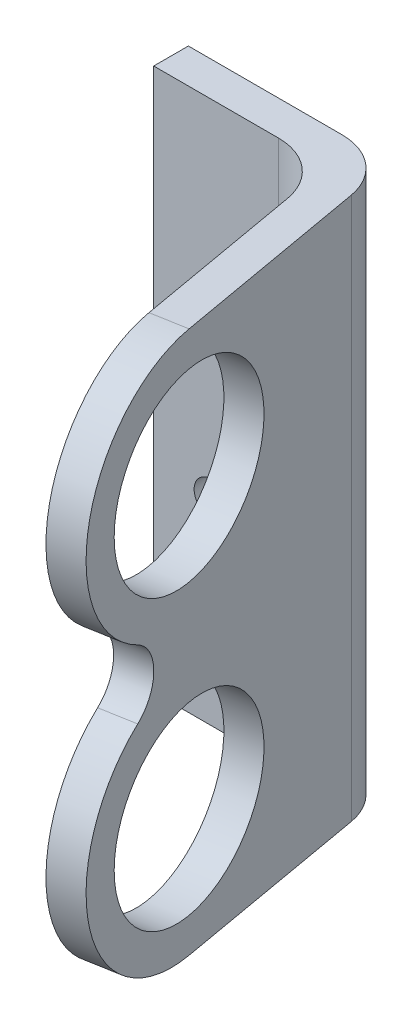
ISO-10303-21;
HEADER;
FILE_DESCRIPTION(('STEP AP214'),'2;1');
FILE_NAME('part.step','',(''),(''),'','','');
FILE_SCHEMA(('AUTOMOTIVE_DESIGN { 1 0 10303 214 1 1 1 1 }'));
ENDSEC;
DATA;
#1=APPLICATION_CONTEXT('core data for automotive mechanical design processes');
#2=APPLICATION_PROTOCOL_DEFINITION('international standard','automotive_design',2000,#1);
#3=PRODUCT_CONTEXT('',#1,'mechanical');
#4=PRODUCT('Part','Part','',(#3));
#5=PRODUCT_RELATED_PRODUCT_CATEGORY('part','',(#4));
#6=PRODUCT_DEFINITION_FORMATION('','',#4);
#7=PRODUCT_DEFINITION_CONTEXT('part definition',#1,'design');
#8=PRODUCT_DEFINITION('design','',#6,#7);
#9=PRODUCT_DEFINITION_SHAPE('','',#8);
#10=(LENGTH_UNIT() NAMED_UNIT(*) SI_UNIT(.MILLI.,.METRE.));
#11=(NAMED_UNIT(*) PLANE_ANGLE_UNIT() SI_UNIT($,.RADIAN.));
#12=(NAMED_UNIT(*) SI_UNIT($,.STERADIAN.) SOLID_ANGLE_UNIT());
#13=UNCERTAINTY_MEASURE_WITH_UNIT(LENGTH_MEASURE(1.E-05),#10,'distance_accuracy_value','');
#14=(GEOMETRIC_REPRESENTATION_CONTEXT(3) GLOBAL_UNCERTAINTY_ASSIGNED_CONTEXT((#13)) GLOBAL_UNIT_ASSIGNED_CONTEXT((#10,
#11,#12)) REPRESENTATION_CONTEXT('',''));
#15=CARTESIAN_POINT('',(0.,0.,0.));
#16=DIRECTION('',(0.,0.,1.));
#17=DIRECTION('',(1.,0.,0.));
#18=AXIS2_PLACEMENT_3D('',#15,#16,#17);
#19=CARTESIAN_POINT('',(17.8888455699224,47.,21.630774973123));
#20=DIRECTION('',(0.984807753012209,0.,-0.173648177666927));
#21=DIRECTION('',(-0.173648177666927,0.,-0.984807753012209));
#22=AXIS2_PLACEMENT_3D('',#19,#20,#21);
#23=PLANE('',#22);
#24=CARTESIAN_POINT('',(15.9787156155862,36.,10.7978896899887));
#25=DIRECTION('',(-0.984807753012209,0.,0.173648177666927));
#26=DIRECTION('',(0.173648177666927,0.,0.984807753012209));
#27=AXIS2_PLACEMENT_3D('',#24,#25,#26);
#28=CIRCLE('',#27,8.);
#29=CARTESIAN_POINT('',(17.3679010369217,36.,18.6763517140864));
#30=VERTEX_POINT('',#29);
#31=EDGE_CURVE('E229',#30,#30,#28,.T.);
#32=ORIENTED_EDGE('',*,*,#31,.F.);
#33=EDGE_LOOP('',(#32));
#34=FACE_BOUND('',#33,.T.);
#35=CARTESIAN_POINT('',(15.9787156155862,11.,10.7978896899887));
#36=DIRECTION('',(-0.984807753012209,0.,0.173648177666927));
#37=DIRECTION('',(0.173648177666927,0.,0.984807753012209));
#38=AXIS2_PLACEMENT_3D('',#35,#36,#37);
#39=CIRCLE('',#38,8.);
#40=CARTESIAN_POINT('',(17.3679010369217,11.,18.6763517140864));
#41=VERTEX_POINT('',#40);
#42=EDGE_CURVE('E222',#41,#41,#39,.T.);
#43=ORIENTED_EDGE('',*,*,#42,.F.);
#44=EDGE_LOOP('',(#43));
#45=FACE_BOUND('',#44,.T.);
#46=CARTESIAN_POINT('',(17.227766400431,23.5,17.8816086978581));
#47=DIRECTION('',(-0.984807753012209,0.,0.173648177666927));
#48=DIRECTION('',(0.173648177666927,0.,0.984807753012209));
#49=AXIS2_PLACEMENT_3D('',#46,#47,#48);
#50=CIRCLE('',#49,3.42183077301811);
#51=CARTESIAN_POINT('',(16.9314073264748,20.5341570820017,16.2008728696517));
#52=VERTEX_POINT('',#51);
#53=CARTESIAN_POINT('',(16.9314073264748,26.4658429179983,16.2008728696517));
#54=VERTEX_POINT('',#53);
#55=EDGE_CURVE('E220',#52,#54,#50,.F.);
#56=ORIENTED_EDGE('',*,*,#55,.T.);
#57=CARTESIAN_POINT('',(15.9787156155862,36.,10.7978896899887));
#58=DIRECTION('',(-0.984807753012209,0.,0.173648177666927));
#59=DIRECTION('',(0.173648177666927,0.,0.984807753012209));
#60=AXIS2_PLACEMENT_3D('',#57,#58,#59);
#61=CIRCLE('',#60,11.);
#62=CARTESIAN_POINT('',(15.9787156155862,47.,10.7978896899887));
#63=VERTEX_POINT('',#62);
#64=EDGE_CURVE('E205',#54,#63,#61,.T.);
#65=ORIENTED_EDGE('',*,*,#64,.T.);
#66=DIRECTION('',(0.173648177666927,0.,0.984807753012209));
#67=VECTOR('',#66,1.);
#68=CARTESIAN_POINT('',(17.8888455699224,47.,21.630774973123));
#69=LINE('',#68,#67);
#70=CARTESIAN_POINT('',(13.4079408490893,47.,-3.78169850557787));
#71=VERTEX_POINT('',#70);
#72=EDGE_CURVE('E258',#71,#63,#69,.T.);
#73=ORIENTED_EDGE('',*,*,#72,.F.);
#74=DIRECTION('',(0.,-1.,0.));
#75=VECTOR('',#74,1.);
#76=CARTESIAN_POINT('',(13.4079408490893,47.,-3.78169850557787));
#77=LINE('',#76,#75);
#78=CARTESIAN_POINT('',(13.4079408490893,0.,-3.78169850557787));
#79=VERTEX_POINT('',#78);
#80=EDGE_CURVE('E288',#71,#79,#77,.T.);
#81=ORIENTED_EDGE('',*,*,#80,.T.);
#82=DIRECTION('',(0.173648177666927,0.,0.984807753012209));
#83=VECTOR('',#82,1.);
#84=CARTESIAN_POINT('',(17.8888455699224,0.,21.630774973123));
#85=LINE('',#84,#83);
#86=CARTESIAN_POINT('',(15.9787156155862,0.,10.7978896899887));
#87=VERTEX_POINT('',#86);
#88=EDGE_CURVE('E273',#79,#87,#85,.T.);
#89=ORIENTED_EDGE('',*,*,#88,.T.);
#90=CARTESIAN_POINT('',(15.9787156155862,11.,10.7978896899887));
#91=DIRECTION('',(-0.984807753012209,0.,0.173648177666927));
#92=DIRECTION('',(0.173648177666927,0.,0.984807753012209));
#93=AXIS2_PLACEMENT_3D('',#90,#91,#92);
#94=CIRCLE('',#93,11.);
#95=EDGE_CURVE('E145',#87,#52,#94,.T.);
#96=ORIENTED_EDGE('',*,*,#95,.T.);
#97=EDGE_LOOP('',(#56,#65,#73,#81,#89,#96));
#98=FACE_BOUND('',#97,.T.);
#99=ADVANCED_FACE('F129',(#34,#45,#98),#23,.F.);
#100=CARTESIAN_POINT('',(15.9252397426211,47.,-6.78169850557787));
#101=DIRECTION('',(-0.984807753012208,0.,0.173648177666928));
#102=DIRECTION('',(0.173648177666928,0.,0.984807753012209));
#103=AXIS2_PLACEMENT_3D('',#100,#101,#102);
#104=PLANE('',#103);
#105=CARTESIAN_POINT('',(18.9331388746229,36.,10.2769451569879));
#106=DIRECTION('',(-0.984807753012208,0.,0.173648177666928));
#107=DIRECTION('',(0.173648177666928,0.,0.984807753012209));
#108=AXIS2_PLACEMENT_3D('',#105,#106,#107);
#109=CIRCLE('',#108,8.);
#110=CARTESIAN_POINT('',(20.3223242959583,36.,18.1554071810856));
#111=VERTEX_POINT('',#110);
#112=EDGE_CURVE('E133',#111,#111,#109,.T.);
#113=ORIENTED_EDGE('',*,*,#112,.T.);
#114=EDGE_LOOP('',(#113));
#115=FACE_BOUND('',#114,.T.);
#116=CARTESIAN_POINT('',(18.9331388746229,11.,10.2769451569879));
#117=DIRECTION('',(-0.984807753012208,0.,0.173648177666928));
#118=DIRECTION('',(0.173648177666928,0.,0.984807753012209));
#119=AXIS2_PLACEMENT_3D('',#116,#117,#118);
#120=CIRCLE('',#119,8.);
#121=CARTESIAN_POINT('',(20.3223242959583,11.,18.1554071810856));
#122=VERTEX_POINT('',#121);
#123=EDGE_CURVE('E214',#122,#122,#120,.T.);
#124=ORIENTED_EDGE('',*,*,#123,.T.);
#125=EDGE_LOOP('',(#124));
#126=FACE_BOUND('',#125,.T.);
#127=CARTESIAN_POINT('',(18.9331388746229,36.,10.2769451569879));
#128=DIRECTION('',(-0.984807753012208,0.,0.173648177666928));
#129=DIRECTION('',(0.173648177666928,0.,0.984807753012209));
#130=AXIS2_PLACEMENT_3D('',#127,#128,#129);
#131=CIRCLE('',#130,11.);
#132=CARTESIAN_POINT('',(19.8858305855114,26.4658429179983,15.679928336651));
#133=VERTEX_POINT('',#132);
#134=CARTESIAN_POINT('',(18.9331388746229,47.,10.2769451569879));
#135=VERTEX_POINT('',#134);
#136=EDGE_CURVE('E153',#133,#135,#131,.T.);
#137=ORIENTED_EDGE('',*,*,#136,.F.);
#138=CARTESIAN_POINT('',(20.1821896594676,23.5,17.3606641648573));
#139=DIRECTION('',(-0.984807753012208,0.,0.173648177666928));
#140=DIRECTION('',(0.173648177666928,0.,0.984807753012209));
#141=AXIS2_PLACEMENT_3D('',#138,#139,#140);
#142=CIRCLE('',#141,3.42183077301811);
#143=CARTESIAN_POINT('',(19.8858305855114,20.5341570820017,15.679928336651));
#144=VERTEX_POINT('',#143);
#145=EDGE_CURVE('E12',#144,#133,#142,.F.);
#146=ORIENTED_EDGE('',*,*,#145,.F.);
#147=CARTESIAN_POINT('',(18.9331388746229,11.,10.2769451569879));
#148=DIRECTION('',(-0.984807753012208,0.,0.173648177666928));
#149=DIRECTION('',(0.173648177666928,0.,0.984807753012209));
#150=AXIS2_PLACEMENT_3D('',#147,#148,#149);
#151=CIRCLE('',#150,11.);
#152=CARTESIAN_POINT('',(18.9331388746229,0.,10.2769451569879));
#153=VERTEX_POINT('',#152);
#154=EDGE_CURVE('E234',#153,#144,#151,.T.);
#155=ORIENTED_EDGE('',*,*,#154,.F.);
#156=DIRECTION('',(-0.173648177666928,0.,-0.984807753012209));
#157=VECTOR('',#156,1.);
#158=CARTESIAN_POINT('',(15.9252397426211,0.,-6.78169850557787));
#159=LINE('',#158,#157);
#160=CARTESIAN_POINT('',(15.9252397426211,0.,-6.78169850557787));
#161=VERTEX_POINT('',#160);
#162=EDGE_CURVE('E275',#153,#161,#159,.T.);
#163=ORIENTED_EDGE('',*,*,#162,.T.);
#164=DIRECTION('',(0.,-1.,0.));
#165=VECTOR('',#164,1.);
#166=CARTESIAN_POINT('',(15.9252397426211,47.,-6.78169850557787));
#167=LINE('',#166,#165);
#168=CARTESIAN_POINT('',(15.9252397426211,47.,-6.78169850557787));
#169=VERTEX_POINT('',#168);
#170=EDGE_CURVE('E285',#169,#161,#167,.T.);
#171=ORIENTED_EDGE('',*,*,#170,.F.);
#172=DIRECTION('',(-0.173648177666928,0.,-0.984807753012209));
#173=VECTOR('',#172,1.);
#174=CARTESIAN_POINT('',(15.9252397426211,47.,-6.78169850557787));
#175=LINE('',#174,#173);
#176=EDGE_CURVE('E260',#135,#169,#175,.T.);
#177=ORIENTED_EDGE('',*,*,#176,.F.);
#178=EDGE_LOOP('',(#137,#146,#155,#163,#171,#177));
#179=FACE_BOUND('',#178,.T.);
#180=ADVANCED_FACE('F302',(#115,#126,#179),#104,.F.);
#181=CARTESIAN_POINT('',(-2.32059976008538,47.,-7.91345761724326));
#182=DIRECTION('',(1.,0.,0.));
#183=DIRECTION('',(0.,0.,-1.));
#184=AXIS2_PLACEMENT_3D('',#181,#182,#183);
#185=PLANE('',#184);
#186=DIRECTION('',(0.,0.,1.));
#187=VECTOR('',#186,1.);
#188=CARTESIAN_POINT('',(-2.32059976008538,0.,-7.91345761724326));
#189=LINE('',#188,#187);
#190=CARTESIAN_POINT('',(-2.32059976008538,0.,-10.9134576172433));
#191=VERTEX_POINT('',#190);
#192=CARTESIAN_POINT('',(-2.32059976008538,0.,-7.91345761724326));
#193=VERTEX_POINT('',#192);
#194=EDGE_CURVE('E247',#191,#193,#189,.T.);
#195=ORIENTED_EDGE('',*,*,#194,.T.);
#196=DIRECTION('',(0.,-1.,0.));
#197=VECTOR('',#196,1.);
#198=CARTESIAN_POINT('',(-2.32059976008538,47.,-7.91345761724326));
#199=LINE('',#198,#197);
#200=CARTESIAN_POINT('',(-2.32059976008538,47.,-7.91345761724326));
#201=VERTEX_POINT('',#200);
#202=EDGE_CURVE('E294',#201,#193,#199,.T.);
#203=ORIENTED_EDGE('',*,*,#202,.F.);
#204=DIRECTION('',(0.,0.,1.));
#205=VECTOR('',#204,1.);
#206=CARTESIAN_POINT('',(-2.32059976008538,47.,-7.91345761724326));
#207=LINE('',#206,#205);
#208=CARTESIAN_POINT('',(-2.32059976008538,47.,-10.9134576172433));
#209=VERTEX_POINT('',#208);
#210=EDGE_CURVE('E250',#209,#201,#207,.T.);
#211=ORIENTED_EDGE('',*,*,#210,.F.);
#212=DIRECTION('',(0.,-1.,0.));
#213=VECTOR('',#212,1.);
#214=CARTESIAN_POINT('',(-2.32059976008538,47.,-10.9134576172433));
#215=LINE('',#214,#213);
#216=EDGE_CURVE('E266',#209,#191,#215,.T.);
#217=ORIENTED_EDGE('',*,*,#216,.T.);
#218=EDGE_LOOP('',(#195,#203,#211,#217));
#219=FACE_BOUND('',#218,.T.);
#220=ADVANCED_FACE('F131',(#219),#185,.F.);
#221=CARTESIAN_POINT('',(8.48390208402817,47.,-7.91345761724326));
#222=DIRECTION('',(0.,0.,-1.));
#223=DIRECTION('',(-1.,0.,0.));
#224=AXIS2_PLACEMENT_3D('',#221,#222,#223);
#225=PLANE('',#224);
#226=CARTESIAN_POINT('',(2.67940023991462,17.,-7.91345761724326));
#227=DIRECTION('',(0.,0.,1.));
#228=DIRECTION('',(1.,0.,0.));
#229=AXIS2_PLACEMENT_3D('',#226,#227,#228);
#230=CIRCLE('',#229,1.5);
#231=CARTESIAN_POINT('',(4.17940023991462,17.,-7.91345761724326));
#232=VERTEX_POINT('',#231);
#233=EDGE_CURVE('E237',#232,#232,#230,.T.);
#234=ORIENTED_EDGE('',*,*,#233,.F.);
#235=EDGE_LOOP('',(#234));
#236=FACE_BOUND('',#235,.T.);
#237=CARTESIAN_POINT('',(2.67940023991462,30.,-7.91345761724326));
#238=DIRECTION('',(0.,0.,1.));
#239=DIRECTION('',(1.,0.,0.));
#240=AXIS2_PLACEMENT_3D('',#237,#238,#239);
#241=CIRCLE('',#240,1.5);
#242=CARTESIAN_POINT('',(4.17940023991462,30.,-7.91345761724326));
#243=VERTEX_POINT('',#242);
#244=EDGE_CURVE('E241',#243,#243,#241,.T.);
#245=ORIENTED_EDGE('',*,*,#244,.F.);
#246=EDGE_LOOP('',(#245));
#247=FACE_BOUND('',#246,.T.);
#248=DIRECTION('',(1.,0.,0.));
#249=VECTOR('',#248,1.);
#250=CARTESIAN_POINT('',(8.48390208402817,0.,-7.91345761724326));
#251=LINE('',#250,#249);
#252=CARTESIAN_POINT('',(8.48390208402817,0.,-7.91345761724326));
#253=VERTEX_POINT('',#252);
#254=EDGE_CURVE('E269',#193,#253,#251,.T.);
#255=ORIENTED_EDGE('',*,*,#254,.T.);
#256=DIRECTION('',(0.,-1.,0.));
#257=VECTOR('',#256,1.);
#258=CARTESIAN_POINT('',(8.48390208402817,47.,-7.91345761724326));
#259=LINE('',#258,#257);
#260=CARTESIAN_POINT('',(8.48390208402817,47.,-7.91345761724326));
#261=VERTEX_POINT('',#260);
#262=EDGE_CURVE('E291',#261,#253,#259,.T.);
#263=ORIENTED_EDGE('',*,*,#262,.F.);
#264=DIRECTION('',(1.,0.,0.));
#265=VECTOR('',#264,1.);
#266=CARTESIAN_POINT('',(8.48390208402817,47.,-7.91345761724326));
#267=LINE('',#266,#265);
#268=EDGE_CURVE('E253',#201,#261,#267,.T.);
#269=ORIENTED_EDGE('',*,*,#268,.F.);
#270=ORIENTED_EDGE('',*,*,#202,.T.);
#271=EDGE_LOOP('',(#255,#263,#269,#270));
#272=FACE_BOUND('',#271,.T.);
#273=ADVANCED_FACE('F332',(#236,#247,#272),#225,.F.);
#274=CARTESIAN_POINT('',(8.4839020840282,47.,-2.91345761724326));
#275=DIRECTION('',(0.,-1.,0.));
#276=DIRECTION('',(0.,0.,-1.));
#277=AXIS2_PLACEMENT_3D('',#274,#275,#276);
#278=CYLINDRICAL_SURFACE('',#277,5.);
#279=CARTESIAN_POINT('',(8.4839020840282,0.,-2.91345761724326));
#280=DIRECTION('',(0.,-1.,0.));
#281=DIRECTION('',(0.,0.,1.));
#282=AXIS2_PLACEMENT_3D('',#279,#280,#281);
#283=CIRCLE('',#282,5.);
#284=EDGE_CURVE('E271',#253,#79,#283,.T.);
#285=ORIENTED_EDGE('',*,*,#284,.T.);
#286=ORIENTED_EDGE('',*,*,#80,.F.);
#287=CARTESIAN_POINT('',(8.4839020840282,47.,-2.91345761724326));
#288=DIRECTION('',(0.,-1.,0.));
#289=DIRECTION('',(0.,0.,1.));
#290=AXIS2_PLACEMENT_3D('',#287,#288,#289);
#291=CIRCLE('',#290,5.);
#292=EDGE_CURVE('E256',#261,#71,#291,.T.);
#293=ORIENTED_EDGE('',*,*,#292,.F.);
#294=ORIENTED_EDGE('',*,*,#262,.T.);
#295=EDGE_LOOP('',(#285,#286,#293,#294));
#296=FACE_BOUND('',#295,.T.);
#297=ADVANCED_FACE('F329',(#296),#278,.F.);
#298=CARTESIAN_POINT('',(11.00120097756,47.,-5.91345761724326));
#299=DIRECTION('',(0.,-1.,0.));
#300=DIRECTION('',(0.,0.,-1.));
#301=AXIS2_PLACEMENT_3D('',#298,#299,#300);
#302=CYLINDRICAL_SURFACE('',#301,5.);
#303=CARTESIAN_POINT('',(11.00120097756,0.,-5.91345761724326));
#304=DIRECTION('',(0.,1.,0.));
#305=DIRECTION('',(0.,0.,1.));
#306=AXIS2_PLACEMENT_3D('',#303,#304,#305);
#307=CIRCLE('',#306,5.);
#308=CARTESIAN_POINT('',(11.00120097756,0.,-10.9134576172433));
#309=VERTEX_POINT('',#308);
#310=EDGE_CURVE('E277',#161,#309,#307,.T.);
#311=ORIENTED_EDGE('',*,*,#310,.T.);
#312=DIRECTION('',(0.,-1.,0.));
#313=VECTOR('',#312,1.);
#314=CARTESIAN_POINT('',(11.00120097756,47.,-10.9134576172433));
#315=LINE('',#314,#313);
#316=CARTESIAN_POINT('',(11.00120097756,47.,-10.9134576172433));
#317=VERTEX_POINT('',#316);
#318=EDGE_CURVE('E282',#317,#309,#315,.T.);
#319=ORIENTED_EDGE('',*,*,#318,.F.);
#320=CARTESIAN_POINT('',(11.00120097756,47.,-5.91345761724326));
#321=DIRECTION('',(0.,1.,0.));
#322=DIRECTION('',(0.,0.,1.));
#323=AXIS2_PLACEMENT_3D('',#320,#321,#322);
#324=CIRCLE('',#323,5.);
#325=EDGE_CURVE('E262',#169,#317,#324,.T.);
#326=ORIENTED_EDGE('',*,*,#325,.F.);
#327=ORIENTED_EDGE('',*,*,#170,.T.);
#328=EDGE_LOOP('',(#311,#319,#326,#327));
#329=FACE_BOUND('',#328,.T.);
#330=ADVANCED_FACE('F331',(#329),#302,.T.);
#331=CARTESIAN_POINT('',(-2.32059976008538,47.,-10.9134576172433));
#332=DIRECTION('',(0.,0.,1.));
#333=DIRECTION('',(1.,0.,0.));
#334=AXIS2_PLACEMENT_3D('',#331,#332,#333);
#335=PLANE('',#334);
#336=CARTESIAN_POINT('',(2.67940023991462,17.,-10.9134576172433));
#337=DIRECTION('',(0.,0.,1.));
#338=DIRECTION('',(1.,0.,0.));
#339=AXIS2_PLACEMENT_3D('',#336,#337,#338);
#340=CIRCLE('',#339,1.5);
#341=CARTESIAN_POINT('',(4.17940023991462,17.,-10.9134576172433));
#342=VERTEX_POINT('',#341);
#343=EDGE_CURVE('E238',#342,#342,#340,.T.);
#344=ORIENTED_EDGE('',*,*,#343,.T.);
#345=EDGE_LOOP('',(#344));
#346=FACE_BOUND('',#345,.T.);
#347=CARTESIAN_POINT('',(2.67940023991462,30.,-10.9134576172433));
#348=DIRECTION('',(0.,0.,1.));
#349=DIRECTION('',(1.,0.,0.));
#350=AXIS2_PLACEMENT_3D('',#347,#348,#349);
#351=CIRCLE('',#350,1.5);
#352=CARTESIAN_POINT('',(4.17940023991462,30.,-10.9134576172433));
#353=VERTEX_POINT('',#352);
#354=EDGE_CURVE('E244',#353,#353,#351,.T.);
#355=ORIENTED_EDGE('',*,*,#354,.T.);
#356=EDGE_LOOP('',(#355));
#357=FACE_BOUND('',#356,.T.);
#358=DIRECTION('',(-1.,0.,0.));
#359=VECTOR('',#358,1.);
#360=CARTESIAN_POINT('',(-2.32059976008538,0.,-10.9134576172433));
#361=LINE('',#360,#359);
#362=EDGE_CURVE('E254',#309,#191,#361,.T.);
#363=ORIENTED_EDGE('',*,*,#362,.T.);
#364=ORIENTED_EDGE('',*,*,#216,.F.);
#365=DIRECTION('',(-1.,0.,0.));
#366=VECTOR('',#365,1.);
#367=CARTESIAN_POINT('',(-2.32059976008538,47.,-10.9134576172433));
#368=LINE('',#367,#366);
#369=EDGE_CURVE('E264',#317,#209,#368,.T.);
#370=ORIENTED_EDGE('',*,*,#369,.F.);
#371=ORIENTED_EDGE('',*,*,#318,.T.);
#372=EDGE_LOOP('',(#363,#364,#370,#371));
#373=FACE_BOUND('',#372,.T.);
#374=ADVANCED_FACE('F363',(#346,#357,#373),#335,.F.);
#375=CARTESIAN_POINT('',(11.00120097756,47.,-5.91345761724326));
#376=DIRECTION('',(0.,1.,0.));
#377=DIRECTION('',(0.,0.,1.));
#378=AXIS2_PLACEMENT_3D('',#375,#376,#377);
#379=PLANE('',#378);
#380=DIRECTION('',(-0.984807753012209,0.,0.173648177666927));
#381=VECTOR('',#380,1.);
#382=CARTESIAN_POINT('',(24.4094436601924,47.,9.31132486870913));
#383=LINE('',#382,#381);
#384=EDGE_CURVE('E209',#135,#63,#383,.T.);
#385=ORIENTED_EDGE('',*,*,#384,.F.);
#386=ORIENTED_EDGE('',*,*,#176,.T.);
#387=ORIENTED_EDGE('',*,*,#325,.T.);
#388=ORIENTED_EDGE('',*,*,#369,.T.);
#389=ORIENTED_EDGE('',*,*,#210,.T.);
#390=ORIENTED_EDGE('',*,*,#268,.T.);
#391=ORIENTED_EDGE('',*,*,#292,.T.);
#392=ORIENTED_EDGE('',*,*,#72,.T.);
#393=EDGE_LOOP('',(#385,#386,#387,#388,#389,#390,#391,#392));
#394=FACE_BOUND('',#393,.T.);
#395=ADVANCED_FACE('F355',(#394),#379,.T.);
#396=CARTESIAN_POINT('',(11.00120097756,0.,-5.91345761724326));
#397=DIRECTION('',(0.,1.,0.));
#398=DIRECTION('',(0.,0.,1.));
#399=AXIS2_PLACEMENT_3D('',#396,#397,#398);
#400=PLANE('',#399);
#401=ORIENTED_EDGE('',*,*,#162,.F.);
#402=DIRECTION('',(-0.984807753012209,0.,0.173648177666927));
#403=VECTOR('',#402,1.);
#404=CARTESIAN_POINT('',(24.4094436601924,0.,9.31132486870913));
#405=LINE('',#404,#403);
#406=EDGE_CURVE('E138',#153,#87,#405,.T.);
#407=ORIENTED_EDGE('',*,*,#406,.T.);
#408=ORIENTED_EDGE('',*,*,#88,.F.);
#409=ORIENTED_EDGE('',*,*,#284,.F.);
#410=ORIENTED_EDGE('',*,*,#254,.F.);
#411=ORIENTED_EDGE('',*,*,#194,.F.);
#412=ORIENTED_EDGE('',*,*,#362,.F.);
#413=ORIENTED_EDGE('',*,*,#310,.F.);
#414=EDGE_LOOP('',(#401,#407,#408,#409,#410,#411,#412,#413));
#415=FACE_BOUND('',#414,.T.);
#416=ADVANCED_FACE('F353',(#415),#400,.F.);
#417=CARTESIAN_POINT('',(2.67940023991462,30.,-10.9134576172433));
#418=DIRECTION('',(0.,0.,1.));
#419=DIRECTION('',(1.,0.,0.));
#420=AXIS2_PLACEMENT_3D('',#417,#418,#419);
#421=CYLINDRICAL_SURFACE('',#420,1.5);
#422=ORIENTED_EDGE('',*,*,#354,.F.);
#423=EDGE_LOOP('',(#422));
#424=FACE_BOUND('',#423,.T.);
#425=ORIENTED_EDGE('',*,*,#244,.T.);
#426=EDGE_LOOP('',(#425));
#427=FACE_BOUND('',#426,.T.);
#428=ADVANCED_FACE('F378',(#424,#427),#421,.F.);
#429=CARTESIAN_POINT('',(2.67940023991462,17.,-10.9134576172433));
#430=DIRECTION('',(0.,0.,1.));
#431=DIRECTION('',(1.,0.,0.));
#432=AXIS2_PLACEMENT_3D('',#429,#430,#431);
#433=CYLINDRICAL_SURFACE('',#432,1.5);
#434=ORIENTED_EDGE('',*,*,#343,.F.);
#435=EDGE_LOOP('',(#434));
#436=FACE_BOUND('',#435,.T.);
#437=ORIENTED_EDGE('',*,*,#233,.T.);
#438=EDGE_LOOP('',(#437));
#439=FACE_BOUND('',#438,.T.);
#440=ADVANCED_FACE('F383',(#436,#439),#433,.F.);
#441=CARTESIAN_POINT('',(24.4094436601924,36.,9.31132486870913));
#442=DIRECTION('',(-0.984807753012209,0.,0.173648177666927));
#443=DIRECTION('',(0.173648177666927,0.,0.984807753012209));
#444=AXIS2_PLACEMENT_3D('',#441,#442,#443);
#445=CYLINDRICAL_SURFACE('',#444,11.);
#446=ORIENTED_EDGE('',*,*,#136,.T.);
#447=ORIENTED_EDGE('',*,*,#384,.T.);
#448=ORIENTED_EDGE('',*,*,#64,.F.);
#449=DIRECTION('',(-0.984807753012209,0.,0.173648177666927));
#450=VECTOR('',#449,1.);
#451=CARTESIAN_POINT('',(25.362135371081,26.4658429179983,14.7143080483722));
#452=LINE('',#451,#450);
#453=EDGE_CURVE('E208',#133,#54,#452,.T.);
#454=ORIENTED_EDGE('',*,*,#453,.F.);
#455=EDGE_LOOP('',(#446,#447,#448,#454));
#456=FACE_BOUND('',#455,.T.);
#457=ADVANCED_FACE('F207',(#456),#445,.T.);
#458=CARTESIAN_POINT('',(24.4094436601924,11.,9.31132486870913));
#459=DIRECTION('',(-0.984807753012209,0.,0.173648177666927));
#460=DIRECTION('',(0.173648177666927,0.,0.984807753012209));
#461=AXIS2_PLACEMENT_3D('',#458,#459,#460);
#462=CYLINDRICAL_SURFACE('',#461,11.);
#463=ORIENTED_EDGE('',*,*,#154,.T.);
#464=DIRECTION('',(-0.984807753012209,0.,0.173648177666927));
#465=VECTOR('',#464,1.);
#466=CARTESIAN_POINT('',(25.362135371081,20.5341570820017,14.7143080483722));
#467=LINE('',#466,#465);
#468=EDGE_CURVE('E223',#144,#52,#467,.T.);
#469=ORIENTED_EDGE('',*,*,#468,.T.);
#470=ORIENTED_EDGE('',*,*,#95,.F.);
#471=ORIENTED_EDGE('',*,*,#406,.F.);
#472=EDGE_LOOP('',(#463,#469,#470,#471));
#473=FACE_BOUND('',#472,.T.);
#474=ADVANCED_FACE('F307',(#473),#462,.T.);
#475=CARTESIAN_POINT('',(24.4094436601924,11.,9.31132486870913));
#476=DIRECTION('',(-0.984807753012209,0.,0.173648177666927));
#477=DIRECTION('',(0.173648177666927,0.,0.984807753012209));
#478=AXIS2_PLACEMENT_3D('',#475,#476,#477);
#479=CYLINDRICAL_SURFACE('',#478,8.);
#480=ORIENTED_EDGE('',*,*,#42,.T.);
#481=EDGE_LOOP('',(#480));
#482=FACE_BOUND('',#481,.T.);
#483=ORIENTED_EDGE('',*,*,#123,.F.);
#484=EDGE_LOOP('',(#483));
#485=FACE_BOUND('',#484,.T.);
#486=ADVANCED_FACE('F305',(#482,#485),#479,.F.);
#487=CARTESIAN_POINT('',(25.6584944450372,23.5,16.3950438765786));
#488=DIRECTION('',(-0.984807753012209,0.,0.173648177666927));
#489=DIRECTION('',(0.173648177666927,0.,0.984807753012209));
#490=AXIS2_PLACEMENT_3D('',#487,#488,#489);
#491=CYLINDRICAL_SURFACE('',#490,3.42183077301811);
#492=ORIENTED_EDGE('',*,*,#145,.T.);
#493=ORIENTED_EDGE('',*,*,#453,.T.);
#494=ORIENTED_EDGE('',*,*,#55,.F.);
#495=ORIENTED_EDGE('',*,*,#468,.F.);
#496=EDGE_LOOP('',(#492,#493,#494,#495));
#497=FACE_BOUND('',#496,.T.);
#498=ADVANCED_FACE('F218',(#497),#491,.F.);
#499=CARTESIAN_POINT('',(24.4094436601924,36.,9.31132486870913));
#500=DIRECTION('',(-0.984807753012209,0.,0.173648177666927));
#501=DIRECTION('',(0.173648177666927,0.,0.984807753012209));
#502=AXIS2_PLACEMENT_3D('',#499,#500,#501);
#503=CYLINDRICAL_SURFACE('',#502,8.);
#504=ORIENTED_EDGE('',*,*,#31,.T.);
#505=EDGE_LOOP('',(#504));
#506=FACE_BOUND('',#505,.T.);
#507=ORIENTED_EDGE('',*,*,#112,.F.);
#508=EDGE_LOOP('',(#507));
#509=FACE_BOUND('',#508,.T.);
#510=ADVANCED_FACE('F314',(#506,#509),#503,.F.);
#511=CLOSED_SHELL('',(#99,#180,#220,#273,#297,#330,#374,#395,#416,#428,#440,#457,#474,#486,#498,#510));
#512=MANIFOLD_SOLID_BREP('B2',#511);
#513=ADVANCED_BREP_SHAPE_REPRESENTATION('',(#18,#512),#14);
#514=SHAPE_DEFINITION_REPRESENTATION(#9,#513);
ENDSEC;
END-ISO-10303-21;
